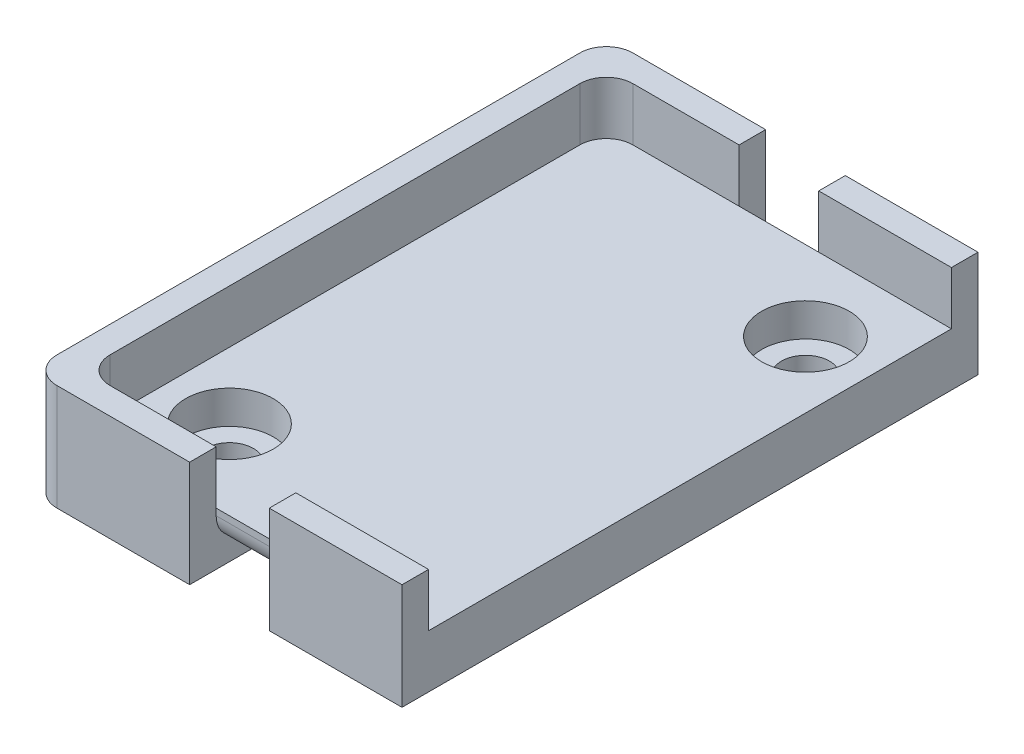
ISO-10303-21;
HEADER;
FILE_DESCRIPTION(('STEP AP214'),'2;1');
FILE_NAME('part.step','',(''),(''),'','','');
FILE_SCHEMA(('AUTOMOTIVE_DESIGN { 1 0 10303 214 1 1 1 1 }'));
ENDSEC;
DATA;
#1=APPLICATION_CONTEXT('core data for automotive mechanical design processes');
#2=APPLICATION_PROTOCOL_DEFINITION('international standard','automotive_design',2000,#1);
#3=PRODUCT_CONTEXT('',#1,'mechanical');
#4=PRODUCT('Part','Part','',(#3));
#5=PRODUCT_RELATED_PRODUCT_CATEGORY('part','',(#4));
#6=PRODUCT_DEFINITION_FORMATION('','',#4);
#7=PRODUCT_DEFINITION_CONTEXT('part definition',#1,'design');
#8=PRODUCT_DEFINITION('design','',#6,#7);
#9=PRODUCT_DEFINITION_SHAPE('','',#8);
#10=(LENGTH_UNIT() NAMED_UNIT(*) SI_UNIT(.MILLI.,.METRE.));
#11=(NAMED_UNIT(*) PLANE_ANGLE_UNIT() SI_UNIT($,.RADIAN.));
#12=(NAMED_UNIT(*) SI_UNIT($,.STERADIAN.) SOLID_ANGLE_UNIT());
#13=UNCERTAINTY_MEASURE_WITH_UNIT(LENGTH_MEASURE(1.E-05),#10,'distance_accuracy_value','');
#14=(GEOMETRIC_REPRESENTATION_CONTEXT(3) GLOBAL_UNCERTAINTY_ASSIGNED_CONTEXT((#13)) GLOBAL_UNIT_ASSIGNED_CONTEXT((#10,
#11,#12)) REPRESENTATION_CONTEXT('',''));
#15=CARTESIAN_POINT('',(0.,0.,0.));
#16=DIRECTION('',(0.,0.,1.));
#17=DIRECTION('',(1.,0.,0.));
#18=AXIS2_PLACEMENT_3D('',#15,#16,#17);
#19=CARTESIAN_POINT('',(0.,5.08,0.));
#20=DIRECTION('',(0.,1.,0.));
#21=DIRECTION('',(0.,0.,1.));
#22=AXIS2_PLACEMENT_3D('',#19,#20,#21);
#23=PLANE('',#22);
#24=CARTESIAN_POINT('',(26.67,5.08,-42.418));
#25=DIRECTION('',(0.,1.,0.));
#26=DIRECTION('',(0.,0.,1.));
#27=AXIS2_PLACEMENT_3D('',#24,#25,#26);
#28=CIRCLE('',#27,4.191);
#29=CARTESIAN_POINT('',(26.67,5.08,-38.227));
#30=VERTEX_POINT('',#29);
#31=EDGE_CURVE('E314',#30,#30,#28,.T.);
#32=ORIENTED_EDGE('',*,*,#31,.F.);
#33=EDGE_LOOP('',(#32));
#34=FACE_BOUND('',#33,.T.);
#35=CARTESIAN_POINT('',(6.35,5.08,-7.62));
#36=DIRECTION('',(0.,1.,0.));
#37=DIRECTION('',(0.,0.,1.));
#38=AXIS2_PLACEMENT_3D('',#35,#36,#37);
#39=CIRCLE('',#38,4.191);
#40=CARTESIAN_POINT('',(6.35,5.08,-3.429));
#41=VERTEX_POINT('',#40);
#42=EDGE_CURVE('E311',#41,#41,#39,.T.);
#43=ORIENTED_EDGE('',*,*,#42,.F.);
#44=EDGE_LOOP('',(#43));
#45=FACE_BOUND('',#44,.T.);
#46=DIRECTION('',(1.,0.,0.));
#47=VECTOR('',#46,1.);
#48=CARTESIAN_POINT('',(0.,5.08,-50.038));
#49=LINE('',#48,#47);
#50=CARTESIAN_POINT('',(2.54,5.08,-50.038));
#51=VERTEX_POINT('',#50);
#52=CARTESIAN_POINT('',(12.7,5.08,-50.038));
#53=VERTEX_POINT('',#52);
#54=EDGE_CURVE('E259',#51,#53,#49,.T.);
#55=ORIENTED_EDGE('',*,*,#54,.F.);
#56=CARTESIAN_POINT('',(2.54,5.08,-47.498));
#57=DIRECTION('',(0.,1.,0.));
#58=DIRECTION('',(0.,0.,1.));
#59=AXIS2_PLACEMENT_3D('',#56,#57,#58);
#60=CIRCLE('',#59,2.54);
#61=CARTESIAN_POINT('',(0.,5.08,-47.498));
#62=VERTEX_POINT('',#61);
#63=EDGE_CURVE('E389',#51,#62,#60,.T.);
#64=ORIENTED_EDGE('',*,*,#63,.T.);
#65=DIRECTION('',(0.,0.,-1.));
#66=VECTOR('',#65,1.);
#67=CARTESIAN_POINT('',(0.,5.08,0.));
#68=LINE('',#67,#66);
#69=CARTESIAN_POINT('',(0.,5.08,-2.54));
#70=VERTEX_POINT('',#69);
#71=EDGE_CURVE('E278',#70,#62,#68,.T.);
#72=ORIENTED_EDGE('',*,*,#71,.F.);
#73=CARTESIAN_POINT('',(2.54,5.08,-2.54));
#74=DIRECTION('',(0.,1.,0.));
#75=DIRECTION('',(0.,0.,1.));
#76=AXIS2_PLACEMENT_3D('',#73,#74,#75);
#77=CIRCLE('',#76,2.54);
#78=CARTESIAN_POINT('',(2.54,5.08,0.));
#79=VERTEX_POINT('',#78);
#80=EDGE_CURVE('E387',#70,#79,#77,.T.);
#81=ORIENTED_EDGE('',*,*,#80,.T.);
#82=DIRECTION('',(1.,0.,0.));
#83=VECTOR('',#82,1.);
#84=CARTESIAN_POINT('',(0.,5.08,0.));
#85=LINE('',#84,#83);
#86=CARTESIAN_POINT('',(12.7,5.08,0.));
#87=VERTEX_POINT('',#86);
#88=EDGE_CURVE('E254',#79,#87,#85,.T.);
#89=ORIENTED_EDGE('',*,*,#88,.T.);
#90=DIRECTION('',(1.,0.,0.));
#91=VECTOR('',#90,1.);
#92=CARTESIAN_POINT('',(0.,5.08,0.));
#93=LINE('',#92,#91);
#94=CARTESIAN_POINT('',(20.32,5.08,0.));
#95=VERTEX_POINT('',#94);
#96=EDGE_CURVE('E306',#87,#95,#93,.T.);
#97=ORIENTED_EDGE('',*,*,#96,.T.);
#98=DIRECTION('',(1.,0.,0.));
#99=VECTOR('',#98,1.);
#100=CARTESIAN_POINT('',(0.,5.08,0.));
#101=LINE('',#100,#99);
#102=CARTESIAN_POINT('',(33.02,5.08,0.));
#103=VERTEX_POINT('',#102);
#104=EDGE_CURVE('E234',#95,#103,#101,.T.);
#105=ORIENTED_EDGE('',*,*,#104,.T.);
#106=DIRECTION('',(0.,0.,-1.));
#107=VECTOR('',#106,1.);
#108=CARTESIAN_POINT('',(33.02,5.08,0.));
#109=LINE('',#108,#107);
#110=CARTESIAN_POINT('',(33.02,5.08,-50.038));
#111=VERTEX_POINT('',#110);
#112=EDGE_CURVE('E309',#103,#111,#109,.T.);
#113=ORIENTED_EDGE('',*,*,#112,.T.);
#114=DIRECTION('',(1.,0.,0.));
#115=VECTOR('',#114,1.);
#116=CARTESIAN_POINT('',(0.,5.08,-50.038));
#117=LINE('',#116,#115);
#118=CARTESIAN_POINT('',(20.32,5.08,-50.038));
#119=VERTEX_POINT('',#118);
#120=EDGE_CURVE('E223',#119,#111,#117,.T.);
#121=ORIENTED_EDGE('',*,*,#120,.F.);
#122=DIRECTION('',(1.,0.,0.));
#123=VECTOR('',#122,1.);
#124=CARTESIAN_POINT('',(0.,5.08,-50.038));
#125=LINE('',#124,#123);
#126=EDGE_CURVE('E303',#53,#119,#125,.T.);
#127=ORIENTED_EDGE('',*,*,#126,.F.);
#128=EDGE_LOOP('',(#55,#64,#72,#81,#89,#97,#105,#113,#121,#127));
#129=FACE_BOUND('',#128,.T.);
#130=ADVANCED_FACE('F34',(#34,#45,#129),#23,.T.);
#131=CARTESIAN_POINT('',(0.,1.905,0.));
#132=DIRECTION('',(0.,1.,0.));
#133=DIRECTION('',(0.,0.,1.));
#134=AXIS2_PLACEMENT_3D('',#131,#132,#133);
#135=PLANE('',#134);
#136=DIRECTION('',(0.,0.,1.));
#137=VECTOR('',#136,1.);
#138=CARTESIAN_POINT('',(12.7,1.905,0.));
#139=LINE('',#138,#137);
#140=CARTESIAN_POINT('',(12.7,1.905,-47.498));
#141=VERTEX_POINT('',#140);
#142=CARTESIAN_POINT('',(12.7,1.905,-2.54));
#143=VERTEX_POINT('',#142);
#144=EDGE_CURVE('E336',#141,#143,#139,.T.);
#145=ORIENTED_EDGE('',*,*,#144,.F.);
#146=DIRECTION('',(1.,0.,0.));
#147=VECTOR('',#146,1.);
#148=CARTESIAN_POINT('',(20.32,1.905,-47.498));
#149=LINE('',#148,#147);
#150=CARTESIAN_POINT('',(20.32,1.905,-47.498));
#151=VERTEX_POINT('',#150);
#152=EDGE_CURVE('E344',#141,#151,#149,.T.);
#153=ORIENTED_EDGE('',*,*,#152,.T.);
#154=DIRECTION('',(0.,0.,-1.));
#155=VECTOR('',#154,1.);
#156=CARTESIAN_POINT('',(20.32,1.905,0.));
#157=LINE('',#156,#155);
#158=CARTESIAN_POINT('',(20.32,1.905,-2.54));
#159=VERTEX_POINT('',#158);
#160=EDGE_CURVE('E360',#159,#151,#157,.T.);
#161=ORIENTED_EDGE('',*,*,#160,.F.);
#162=DIRECTION('',(1.,0.,0.));
#163=VECTOR('',#162,1.);
#164=CARTESIAN_POINT('',(0.,1.905,-2.54));
#165=LINE('',#164,#163);
#166=EDGE_CURVE('E342',#159,#143,#165,.F.);
#167=ORIENTED_EDGE('',*,*,#166,.T.);
#168=EDGE_LOOP('',(#145,#153,#161,#167));
#169=FACE_BOUND('',#168,.T.);
#170=ADVANCED_FACE('F364',(#169),#135,.F.);
#171=CARTESIAN_POINT('',(0.,1.905,0.));
#172=DIRECTION('',(0.,1.,0.));
#173=DIRECTION('',(0.,0.,1.));
#174=AXIS2_PLACEMENT_3D('',#171,#172,#173);
#175=PLANE('',#174);
#176=CARTESIAN_POINT('',(6.35,1.905,-7.62));
#177=DIRECTION('',(0.,1.,0.));
#178=DIRECTION('',(0.,0.,1.));
#179=AXIS2_PLACEMENT_3D('',#176,#177,#178);
#180=CIRCLE('',#179,2.28599999999999);
#181=CARTESIAN_POINT('',(6.35,1.905,-5.334));
#182=VERTEX_POINT('',#181);
#183=EDGE_CURVE('E333',#182,#182,#180,.T.);
#184=ORIENTED_EDGE('',*,*,#183,.F.);
#185=EDGE_LOOP('',(#184));
#186=FACE_BOUND('',#185,.T.);
#187=CARTESIAN_POINT('',(6.35,1.905,-7.62));
#188=DIRECTION('',(0.,1.,0.));
#189=DIRECTION('',(0.,0.,1.));
#190=AXIS2_PLACEMENT_3D('',#187,#188,#189);
#191=CIRCLE('',#190,4.191);
#192=CARTESIAN_POINT('',(6.35,1.905,-3.429));
#193=VERTEX_POINT('',#192);
#194=EDGE_CURVE('E291',#193,#193,#191,.T.);
#195=ORIENTED_EDGE('',*,*,#194,.T.);
#196=EDGE_LOOP('',(#195));
#197=FACE_BOUND('',#196,.T.);
#198=ADVANCED_FACE('F447',(#186,#197),#175,.T.);
#199=CARTESIAN_POINT('',(12.7,1.905,0.));
#200=DIRECTION('',(1.,0.,0.));
#201=DIRECTION('',(0.,0.,-1.));
#202=AXIS2_PLACEMENT_3D('',#199,#200,#201);
#203=PLANE('',#202);
#204=DIRECTION('',(0.,0.,1.));
#205=VECTOR('',#204,1.);
#206=CARTESIAN_POINT('',(12.7,0.,0.));
#207=LINE('',#206,#205);
#208=CARTESIAN_POINT('',(12.7,0.,-52.578));
#209=VERTEX_POINT('',#208);
#210=CARTESIAN_POINT('',(12.7,0.,2.54));
#211=VERTEX_POINT('',#210);
#212=EDGE_CURVE('E376',#209,#211,#207,.T.);
#213=ORIENTED_EDGE('',*,*,#212,.F.);
#214=DIRECTION('',(0.,-1.,0.));
#215=VECTOR('',#214,1.);
#216=CARTESIAN_POINT('',(12.7,1.905,-52.578));
#217=LINE('',#216,#215);
#218=CARTESIAN_POINT('',(12.7,10.16,-52.578));
#219=VERTEX_POINT('',#218);
#220=EDGE_CURVE('E367',#219,#209,#217,.T.);
#221=ORIENTED_EDGE('',*,*,#220,.F.);
#222=DIRECTION('',(0.,0.,1.));
#223=VECTOR('',#222,1.);
#224=CARTESIAN_POINT('',(12.7,10.16,0.));
#225=LINE('',#224,#223);
#226=CARTESIAN_POINT('',(12.7,10.16,-50.038));
#227=VERTEX_POINT('',#226);
#228=EDGE_CURVE('E255',#219,#227,#225,.T.);
#229=ORIENTED_EDGE('',*,*,#228,.T.);
#230=DIRECTION('',(0.,-1.,0.));
#231=VECTOR('',#230,1.);
#232=CARTESIAN_POINT('',(12.7,10.16,-50.038));
#233=LINE('',#232,#231);
#234=EDGE_CURVE('E276',#227,#53,#233,.T.);
#235=ORIENTED_EDGE('',*,*,#234,.T.);
#236=DIRECTION('',(0.,-1.,0.));
#237=VECTOR('',#236,1.);
#238=CARTESIAN_POINT('',(12.7,5.08,-50.038));
#239=LINE('',#238,#237);
#240=CARTESIAN_POINT('',(12.7,4.445,-50.038));
#241=VERTEX_POINT('',#240);
#242=EDGE_CURVE('E373',#53,#241,#239,.T.);
#243=ORIENTED_EDGE('',*,*,#242,.T.);
#244=CARTESIAN_POINT('',(12.7,4.445,-47.498));
#245=DIRECTION('',(1.,0.,0.));
#246=DIRECTION('',(0.,0.,-1.));
#247=AXIS2_PLACEMENT_3D('',#244,#245,#246);
#248=CIRCLE('',#247,2.54);
#249=EDGE_CURVE('E357',#241,#141,#248,.F.);
#250=ORIENTED_EDGE('',*,*,#249,.T.);
#251=ORIENTED_EDGE('',*,*,#144,.T.);
#252=CARTESIAN_POINT('',(12.7,4.445,-2.54));
#253=DIRECTION('',(1.,0.,0.));
#254=DIRECTION('',(0.,0.,-1.));
#255=AXIS2_PLACEMENT_3D('',#252,#253,#254);
#256=CIRCLE('',#255,2.54);
#257=CARTESIAN_POINT('',(12.7,4.445,0.));
#258=VERTEX_POINT('',#257);
#259=EDGE_CURVE('E11',#143,#258,#256,.F.);
#260=ORIENTED_EDGE('',*,*,#259,.T.);
#261=DIRECTION('',(0.,-1.,0.));
#262=VECTOR('',#261,1.);
#263=CARTESIAN_POINT('',(12.7,5.08,0.));
#264=LINE('',#263,#262);
#265=EDGE_CURVE('E330',#87,#258,#264,.T.);
#266=ORIENTED_EDGE('',*,*,#265,.F.);
#267=DIRECTION('',(0.,-1.,0.));
#268=VECTOR('',#267,1.);
#269=CARTESIAN_POINT('',(12.7,10.16,0.));
#270=LINE('',#269,#268);
#271=CARTESIAN_POINT('',(12.7,10.16,0.));
#272=VERTEX_POINT('',#271);
#273=EDGE_CURVE('E284',#272,#87,#270,.T.);
#274=ORIENTED_EDGE('',*,*,#273,.F.);
#275=CARTESIAN_POINT('',(12.7,10.16,2.54));
#276=VERTEX_POINT('',#275);
#277=EDGE_CURVE('E260',#272,#276,#225,.T.);
#278=ORIENTED_EDGE('',*,*,#277,.T.);
#279=DIRECTION('',(0.,-1.,0.));
#280=VECTOR('',#279,1.);
#281=CARTESIAN_POINT('',(12.7,1.905,2.54));
#282=LINE('',#281,#280);
#283=EDGE_CURVE('E439',#276,#211,#282,.T.);
#284=ORIENTED_EDGE('',*,*,#283,.T.);
#285=EDGE_LOOP('',(#213,#221,#229,#235,#243,#250,#251,#260,#266,#274,#278,#284));
#286=FACE_BOUND('',#285,.T.);
#287=ADVANCED_FACE('F450',(#286),#203,.T.);
#288=CARTESIAN_POINT('',(0.,1.905,-52.578));
#289=DIRECTION('',(0.,0.,1.));
#290=DIRECTION('',(1.,0.,0.));
#291=AXIS2_PLACEMENT_3D('',#288,#289,#290);
#292=PLANE('',#291);
#293=DIRECTION('',(-1.,0.,0.));
#294=VECTOR('',#293,1.);
#295=CARTESIAN_POINT('',(0.,0.,-52.578));
#296=LINE('',#295,#294);
#297=CARTESIAN_POINT('',(0.,0.,-52.578));
#298=VERTEX_POINT('',#297);
#299=EDGE_CURVE('E436',#209,#298,#296,.T.);
#300=ORIENTED_EDGE('',*,*,#299,.T.);
#301=DIRECTION('',(0.,-1.,0.));
#302=VECTOR('',#301,1.);
#303=CARTESIAN_POINT('',(0.,10.16,-52.578));
#304=LINE('',#303,#302);
#305=CARTESIAN_POINT('',(0.,10.16,-52.578));
#306=VERTEX_POINT('',#305);
#307=EDGE_CURVE('E407',#298,#306,#304,.F.);
#308=ORIENTED_EDGE('',*,*,#307,.T.);
#309=DIRECTION('',(-1.,0.,0.));
#310=VECTOR('',#309,1.);
#311=CARTESIAN_POINT('',(0.,10.16,-52.578));
#312=LINE('',#311,#310);
#313=EDGE_CURVE('E258',#219,#306,#312,.T.);
#314=ORIENTED_EDGE('',*,*,#313,.F.);
#315=ORIENTED_EDGE('',*,*,#220,.T.);
#316=EDGE_LOOP('',(#300,#308,#314,#315));
#317=FACE_BOUND('',#316,.T.);
#318=ADVANCED_FACE('F580',(#317),#292,.F.);
#319=CARTESIAN_POINT('',(-2.54,1.905,0.));
#320=DIRECTION('',(-1.,0.,0.));
#321=DIRECTION('',(0.,0.,1.));
#322=AXIS2_PLACEMENT_3D('',#319,#320,#321);
#323=PLANE('',#322);
#324=DIRECTION('',(0.,0.,-1.));
#325=VECTOR('',#324,1.);
#326=CARTESIAN_POINT('',(-2.54,10.16,0.));
#327=LINE('',#326,#325);
#328=CARTESIAN_POINT('',(-2.54,10.16,0.));
#329=VERTEX_POINT('',#328);
#330=CARTESIAN_POINT('',(-2.54,10.16,-50.038));
#331=VERTEX_POINT('',#330);
#332=EDGE_CURVE('E263',#329,#331,#327,.T.);
#333=ORIENTED_EDGE('',*,*,#332,.T.);
#334=DIRECTION('',(0.,-1.,0.));
#335=VECTOR('',#334,1.);
#336=CARTESIAN_POINT('',(-2.54,0.,-50.038));
#337=LINE('',#336,#335);
#338=CARTESIAN_POINT('',(-2.54,0.,-50.038));
#339=VERTEX_POINT('',#338);
#340=EDGE_CURVE('E400',#331,#339,#337,.T.);
#341=ORIENTED_EDGE('',*,*,#340,.T.);
#342=DIRECTION('',(0.,0.,-1.));
#343=VECTOR('',#342,1.);
#344=CARTESIAN_POINT('',(-2.54,0.,0.));
#345=LINE('',#344,#343);
#346=CARTESIAN_POINT('',(-2.54,0.,0.));
#347=VERTEX_POINT('',#346);
#348=EDGE_CURVE('E432',#347,#339,#345,.T.);
#349=ORIENTED_EDGE('',*,*,#348,.F.);
#350=DIRECTION('',(0.,-1.,0.));
#351=VECTOR('',#350,1.);
#352=CARTESIAN_POINT('',(-2.54,1.905,0.));
#353=LINE('',#352,#351);
#354=EDGE_CURVE('E398',#347,#329,#353,.F.);
#355=ORIENTED_EDGE('',*,*,#354,.T.);
#356=EDGE_LOOP('',(#333,#341,#349,#355));
#357=FACE_BOUND('',#356,.T.);
#358=ADVANCED_FACE('F575',(#357),#323,.T.);
#359=CARTESIAN_POINT('',(0.,1.905,2.54));
#360=DIRECTION('',(0.,0.,1.));
#361=DIRECTION('',(1.,0.,0.));
#362=AXIS2_PLACEMENT_3D('',#359,#360,#361);
#363=PLANE('',#362);
#364=DIRECTION('',(-1.,0.,0.));
#365=VECTOR('',#364,1.);
#366=CARTESIAN_POINT('',(0.,10.16,2.54));
#367=LINE('',#366,#365);
#368=CARTESIAN_POINT('',(0.,10.16,2.54));
#369=VERTEX_POINT('',#368);
#370=EDGE_CURVE('E266',#276,#369,#367,.T.);
#371=ORIENTED_EDGE('',*,*,#370,.T.);
#372=DIRECTION('',(0.,-1.,0.));
#373=VECTOR('',#372,1.);
#374=CARTESIAN_POINT('',(0.,1.905,2.54));
#375=LINE('',#374,#373);
#376=CARTESIAN_POINT('',(0.,0.,2.54));
#377=VERTEX_POINT('',#376);
#378=EDGE_CURVE('E340',#369,#377,#375,.T.);
#379=ORIENTED_EDGE('',*,*,#378,.T.);
#380=DIRECTION('',(-1.,0.,0.));
#381=VECTOR('',#380,1.);
#382=CARTESIAN_POINT('',(0.,0.,2.54));
#383=LINE('',#382,#381);
#384=EDGE_CURVE('E420',#211,#377,#383,.T.);
#385=ORIENTED_EDGE('',*,*,#384,.F.);
#386=ORIENTED_EDGE('',*,*,#283,.F.);
#387=EDGE_LOOP('',(#371,#379,#385,#386));
#388=FACE_BOUND('',#387,.T.);
#389=ADVANCED_FACE('F419',(#388),#363,.T.);
#390=CARTESIAN_POINT('',(6.35,1.905,-7.62));
#391=DIRECTION('',(0.,-1.,0.));
#392=DIRECTION('',(0.,0.,-1.));
#393=AXIS2_PLACEMENT_3D('',#390,#391,#392);
#394=CYLINDRICAL_SURFACE('',#393,2.28599999999999);
#395=ORIENTED_EDGE('',*,*,#183,.T.);
#396=EDGE_LOOP('',(#395));
#397=FACE_BOUND('',#396,.T.);
#398=CARTESIAN_POINT('',(6.35,0.,-7.62));
#399=DIRECTION('',(0.,1.,0.));
#400=DIRECTION('',(0.,0.,1.));
#401=AXIS2_PLACEMENT_3D('',#398,#399,#400);
#402=CIRCLE('',#401,2.28599999999999);
#403=CARTESIAN_POINT('',(6.35,0.,-5.334));
#404=VERTEX_POINT('',#403);
#405=EDGE_CURVE('E339',#404,#404,#402,.T.);
#406=ORIENTED_EDGE('',*,*,#405,.F.);
#407=EDGE_LOOP('',(#406));
#408=FACE_BOUND('',#407,.T.);
#409=ADVANCED_FACE('F444',(#397,#408),#394,.F.);
#410=CARTESIAN_POINT('',(0.,0.,0.));
#411=DIRECTION('',(0.,1.,0.));
#412=DIRECTION('',(0.,0.,1.));
#413=AXIS2_PLACEMENT_3D('',#410,#411,#412);
#414=PLANE('',#413);
#415=ORIENTED_EDGE('',*,*,#348,.T.);
#416=CARTESIAN_POINT('',(0.,0.,-50.038));
#417=DIRECTION('',(0.,1.,0.));
#418=DIRECTION('',(0.,0.,1.));
#419=AXIS2_PLACEMENT_3D('',#416,#417,#418);
#420=CIRCLE('',#419,2.54);
#421=EDGE_CURVE('E405',#339,#298,#420,.F.);
#422=ORIENTED_EDGE('',*,*,#421,.T.);
#423=ORIENTED_EDGE('',*,*,#299,.F.);
#424=ORIENTED_EDGE('',*,*,#212,.T.);
#425=ORIENTED_EDGE('',*,*,#384,.T.);
#426=CARTESIAN_POINT('',(0.,0.,0.));
#427=DIRECTION('',(0.,1.,0.));
#428=DIRECTION('',(0.,0.,1.));
#429=AXIS2_PLACEMENT_3D('',#426,#427,#428);
#430=CIRCLE('',#429,2.54);
#431=EDGE_CURVE('E403',#377,#347,#430,.F.);
#432=ORIENTED_EDGE('',*,*,#431,.T.);
#433=EDGE_LOOP('',(#415,#422,#423,#424,#425,#432));
#434=FACE_BOUND('',#433,.T.);
#435=ORIENTED_EDGE('',*,*,#405,.T.);
#436=EDGE_LOOP('',(#435));
#437=FACE_BOUND('',#436,.T.);
#438=ADVANCED_FACE('F427',(#434,#437),#414,.F.);
#439=CARTESIAN_POINT('',(0.,5.08,-50.038));
#440=DIRECTION('',(0.,0.,-1.));
#441=DIRECTION('',(-1.,0.,0.));
#442=AXIS2_PLACEMENT_3D('',#439,#440,#441);
#443=PLANE('',#442);
#444=DIRECTION('',(0.,-1.,0.));
#445=VECTOR('',#444,1.);
#446=CARTESIAN_POINT('',(20.32,5.08,-50.038));
#447=LINE('',#446,#445);
#448=CARTESIAN_POINT('',(20.32,4.445,-50.038));
#449=VERTEX_POINT('',#448);
#450=EDGE_CURVE('E206',#119,#449,#447,.T.);
#451=ORIENTED_EDGE('',*,*,#450,.T.);
#452=DIRECTION('',(1.,0.,0.));
#453=VECTOR('',#452,1.);
#454=CARTESIAN_POINT('',(12.7,4.445,-50.038));
#455=LINE('',#454,#453);
#456=EDGE_CURVE('E347',#449,#241,#455,.F.);
#457=ORIENTED_EDGE('',*,*,#456,.T.);
#458=ORIENTED_EDGE('',*,*,#242,.F.);
#459=ORIENTED_EDGE('',*,*,#126,.T.);
#460=EDGE_LOOP('',(#451,#457,#458,#459));
#461=FACE_BOUND('',#460,.T.);
#462=ADVANCED_FACE('F551',(#461),#443,.T.);
#463=CARTESIAN_POINT('',(0.,5.08,0.));
#464=DIRECTION('',(0.,0.,-1.));
#465=DIRECTION('',(-1.,0.,0.));
#466=AXIS2_PLACEMENT_3D('',#463,#464,#465);
#467=PLANE('',#466);
#468=ORIENTED_EDGE('',*,*,#265,.T.);
#469=DIRECTION('',(1.,0.,0.));
#470=VECTOR('',#469,1.);
#471=CARTESIAN_POINT('',(0.,4.445,0.));
#472=LINE('',#471,#470);
#473=CARTESIAN_POINT('',(20.32,4.445,0.));
#474=VERTEX_POINT('',#473);
#475=EDGE_CURVE('E349',#258,#474,#472,.T.);
#476=ORIENTED_EDGE('',*,*,#475,.T.);
#477=DIRECTION('',(0.,-1.,0.));
#478=VECTOR('',#477,1.);
#479=CARTESIAN_POINT('',(20.32,5.08,0.));
#480=LINE('',#479,#478);
#481=EDGE_CURVE('E328',#95,#474,#480,.T.);
#482=ORIENTED_EDGE('',*,*,#481,.F.);
#483=ORIENTED_EDGE('',*,*,#96,.F.);
#484=EDGE_LOOP('',(#468,#476,#482,#483));
#485=FACE_BOUND('',#484,.T.);
#486=ADVANCED_FACE('F370',(#485),#467,.F.);
#487=CARTESIAN_POINT('',(20.32,5.08,0.));
#488=DIRECTION('',(1.,0.,0.));
#489=DIRECTION('',(0.,0.,-1.));
#490=AXIS2_PLACEMENT_3D('',#487,#488,#489);
#491=PLANE('',#490);
#492=ORIENTED_EDGE('',*,*,#481,.T.);
#493=CARTESIAN_POINT('',(20.32,4.445,-2.54));
#494=DIRECTION('',(1.,0.,0.));
#495=DIRECTION('',(0.,0.,-1.));
#496=AXIS2_PLACEMENT_3D('',#493,#494,#495);
#497=CIRCLE('',#496,2.54);
#498=EDGE_CURVE('E42',#474,#159,#497,.T.);
#499=ORIENTED_EDGE('',*,*,#498,.T.);
#500=ORIENTED_EDGE('',*,*,#160,.T.);
#501=CARTESIAN_POINT('',(20.32,4.445,-47.498));
#502=DIRECTION('',(1.,0.,0.));
#503=DIRECTION('',(0.,0.,-1.));
#504=AXIS2_PLACEMENT_3D('',#501,#502,#503);
#505=CIRCLE('',#504,2.54);
#506=EDGE_CURVE('E355',#151,#449,#505,.T.);
#507=ORIENTED_EDGE('',*,*,#506,.T.);
#508=ORIENTED_EDGE('',*,*,#450,.F.);
#509=DIRECTION('',(0.,-1.,0.));
#510=VECTOR('',#509,1.);
#511=CARTESIAN_POINT('',(20.32,10.16,-50.038));
#512=LINE('',#511,#510);
#513=CARTESIAN_POINT('',(20.32,10.16,-50.038));
#514=VERTEX_POINT('',#513);
#515=EDGE_CURVE('E214',#514,#119,#512,.T.);
#516=ORIENTED_EDGE('',*,*,#515,.F.);
#517=DIRECTION('',(0.,0.,1.));
#518=VECTOR('',#517,1.);
#519=CARTESIAN_POINT('',(20.32,10.16,0.));
#520=LINE('',#519,#518);
#521=CARTESIAN_POINT('',(20.32,10.16,-52.578));
#522=VERTEX_POINT('',#521);
#523=EDGE_CURVE('E209',#522,#514,#520,.T.);
#524=ORIENTED_EDGE('',*,*,#523,.F.);
#525=DIRECTION('',(0.,-1.,0.));
#526=VECTOR('',#525,1.);
#527=CARTESIAN_POINT('',(20.32,5.08,-52.578));
#528=LINE('',#527,#526);
#529=CARTESIAN_POINT('',(20.32,0.,-52.578));
#530=VERTEX_POINT('',#529);
#531=EDGE_CURVE('E195',#522,#530,#528,.T.);
#532=ORIENTED_EDGE('',*,*,#531,.T.);
#533=DIRECTION('',(0.,0.,1.));
#534=VECTOR('',#533,1.);
#535=CARTESIAN_POINT('',(20.32,0.,0.));
#536=LINE('',#535,#534);
#537=CARTESIAN_POINT('',(20.32,0.,2.54));
#538=VERTEX_POINT('',#537);
#539=EDGE_CURVE('E296',#530,#538,#536,.T.);
#540=ORIENTED_EDGE('',*,*,#539,.T.);
#541=DIRECTION('',(0.,-1.,0.));
#542=VECTOR('',#541,1.);
#543=CARTESIAN_POINT('',(20.32,5.08,2.54));
#544=LINE('',#543,#542);
#545=CARTESIAN_POINT('',(20.32,10.16,2.54));
#546=VERTEX_POINT('',#545);
#547=EDGE_CURVE('E326',#546,#538,#544,.T.);
#548=ORIENTED_EDGE('',*,*,#547,.F.);
#549=DIRECTION('',(0.,0.,1.));
#550=VECTOR('',#549,1.);
#551=CARTESIAN_POINT('',(20.32,10.16,0.));
#552=LINE('',#551,#550);
#553=CARTESIAN_POINT('',(20.32,10.16,0.));
#554=VERTEX_POINT('',#553);
#555=EDGE_CURVE('E238',#554,#546,#552,.T.);
#556=ORIENTED_EDGE('',*,*,#555,.F.);
#557=DIRECTION('',(0.,-1.,0.));
#558=VECTOR('',#557,1.);
#559=CARTESIAN_POINT('',(20.32,10.16,0.));
#560=LINE('',#559,#558);
#561=EDGE_CURVE('E251',#554,#95,#560,.T.);
#562=ORIENTED_EDGE('',*,*,#561,.T.);
#563=EDGE_LOOP('',(#492,#499,#500,#507,#508,#516,#524,#532,#540,#548,#556,#562));
#564=FACE_BOUND('',#563,.T.);
#565=ADVANCED_FACE('F211',(#564),#491,.F.);
#566=CARTESIAN_POINT('',(0.,5.08,2.54));
#567=DIRECTION('',(0.,0.,1.));
#568=DIRECTION('',(1.,0.,0.));
#569=AXIS2_PLACEMENT_3D('',#566,#567,#568);
#570=PLANE('',#569);
#571=ORIENTED_EDGE('',*,*,#547,.T.);
#572=DIRECTION('',(-1.,0.,0.));
#573=VECTOR('',#572,1.);
#574=CARTESIAN_POINT('',(0.,0.,2.54));
#575=LINE('',#574,#573);
#576=CARTESIAN_POINT('',(33.02,0.,2.54));
#577=VERTEX_POINT('',#576);
#578=EDGE_CURVE('E298',#577,#538,#575,.T.);
#579=ORIENTED_EDGE('',*,*,#578,.F.);
#580=DIRECTION('',(0.,-1.,0.));
#581=VECTOR('',#580,1.);
#582=CARTESIAN_POINT('',(33.02,5.08,2.54));
#583=LINE('',#582,#581);
#584=CARTESIAN_POINT('',(33.02,10.16,2.54));
#585=VERTEX_POINT('',#584);
#586=EDGE_CURVE('E324',#585,#577,#583,.T.);
#587=ORIENTED_EDGE('',*,*,#586,.F.);
#588=DIRECTION('',(-1.,0.,0.));
#589=VECTOR('',#588,1.);
#590=CARTESIAN_POINT('',(0.,10.16,2.54));
#591=LINE('',#590,#589);
#592=EDGE_CURVE('E241',#585,#546,#591,.T.);
#593=ORIENTED_EDGE('',*,*,#592,.T.);
#594=EDGE_LOOP('',(#571,#579,#587,#593));
#595=FACE_BOUND('',#594,.T.);
#596=ADVANCED_FACE('F564',(#595),#570,.T.);
#597=CARTESIAN_POINT('',(33.02,5.08,0.));
#598=DIRECTION('',(-1.,0.,0.));
#599=DIRECTION('',(0.,0.,1.));
#600=AXIS2_PLACEMENT_3D('',#597,#598,#599);
#601=PLANE('',#600);
#602=ORIENTED_EDGE('',*,*,#586,.T.);
#603=DIRECTION('',(0.,0.,-1.));
#604=VECTOR('',#603,1.);
#605=CARTESIAN_POINT('',(33.02,0.,0.));
#606=LINE('',#605,#604);
#607=CARTESIAN_POINT('',(33.02,0.,-52.578));
#608=VERTEX_POINT('',#607);
#609=EDGE_CURVE('E287',#577,#608,#606,.T.);
#610=ORIENTED_EDGE('',*,*,#609,.T.);
#611=DIRECTION('',(0.,-1.,0.));
#612=VECTOR('',#611,1.);
#613=CARTESIAN_POINT('',(33.02,5.08,-52.578));
#614=LINE('',#613,#612);
#615=CARTESIAN_POINT('',(33.02,10.16,-52.578));
#616=VERTEX_POINT('',#615);
#617=EDGE_CURVE('E205',#616,#608,#614,.T.);
#618=ORIENTED_EDGE('',*,*,#617,.F.);
#619=DIRECTION('',(0.,0.,-1.));
#620=VECTOR('',#619,1.);
#621=CARTESIAN_POINT('',(33.02,10.16,0.));
#622=LINE('',#621,#620);
#623=CARTESIAN_POINT('',(33.02,10.16,-50.038));
#624=VERTEX_POINT('',#623);
#625=EDGE_CURVE('E222',#624,#616,#622,.T.);
#626=ORIENTED_EDGE('',*,*,#625,.F.);
#627=DIRECTION('',(0.,-1.,0.));
#628=VECTOR('',#627,1.);
#629=CARTESIAN_POINT('',(33.02,10.16,-50.038));
#630=LINE('',#629,#628);
#631=EDGE_CURVE('E229',#624,#111,#630,.T.);
#632=ORIENTED_EDGE('',*,*,#631,.T.);
#633=ORIENTED_EDGE('',*,*,#112,.F.);
#634=DIRECTION('',(0.,-1.,0.));
#635=VECTOR('',#634,1.);
#636=CARTESIAN_POINT('',(33.02,10.16,0.));
#637=LINE('',#636,#635);
#638=CARTESIAN_POINT('',(33.02,10.16,0.));
#639=VERTEX_POINT('',#638);
#640=EDGE_CURVE('E246',#639,#103,#637,.T.);
#641=ORIENTED_EDGE('',*,*,#640,.F.);
#642=DIRECTION('',(0.,0.,-1.));
#643=VECTOR('',#642,1.);
#644=CARTESIAN_POINT('',(33.02,10.16,0.));
#645=LINE('',#644,#643);
#646=EDGE_CURVE('E244',#585,#639,#645,.T.);
#647=ORIENTED_EDGE('',*,*,#646,.F.);
#648=EDGE_LOOP('',(#602,#610,#618,#626,#632,#633,#641,#647));
#649=FACE_BOUND('',#648,.T.);
#650=ADVANCED_FACE('F466',(#649),#601,.F.);
#651=CARTESIAN_POINT('',(0.,5.08,-52.578));
#652=DIRECTION('',(0.,0.,1.));
#653=DIRECTION('',(1.,0.,0.));
#654=AXIS2_PLACEMENT_3D('',#651,#652,#653);
#655=PLANE('',#654);
#656=ORIENTED_EDGE('',*,*,#617,.T.);
#657=DIRECTION('',(-1.,0.,0.));
#658=VECTOR('',#657,1.);
#659=CARTESIAN_POINT('',(0.,0.,-52.578));
#660=LINE('',#659,#658);
#661=EDGE_CURVE('E201',#608,#530,#660,.T.);
#662=ORIENTED_EDGE('',*,*,#661,.T.);
#663=ORIENTED_EDGE('',*,*,#531,.F.);
#664=DIRECTION('',(-1.,0.,0.));
#665=VECTOR('',#664,1.);
#666=CARTESIAN_POINT('',(0.,10.16,-52.578));
#667=LINE('',#666,#665);
#668=EDGE_CURVE('E199',#616,#522,#667,.T.);
#669=ORIENTED_EDGE('',*,*,#668,.F.);
#670=EDGE_LOOP('',(#656,#662,#663,#669));
#671=FACE_BOUND('',#670,.T.);
#672=ADVANCED_FACE('F197',(#671),#655,.F.);
#673=CARTESIAN_POINT('',(6.35,5.08,-7.62));
#674=DIRECTION('',(0.,-1.,0.));
#675=DIRECTION('',(0.,0.,-1.));
#676=AXIS2_PLACEMENT_3D('',#673,#674,#675);
#677=CYLINDRICAL_SURFACE('',#676,4.191);
#678=ORIENTED_EDGE('',*,*,#42,.T.);
#679=EDGE_LOOP('',(#678));
#680=FACE_BOUND('',#679,.T.);
#681=ORIENTED_EDGE('',*,*,#194,.F.);
#682=EDGE_LOOP('',(#681));
#683=FACE_BOUND('',#682,.T.);
#684=ADVANCED_FACE('F454',(#680,#683),#677,.F.);
#685=CARTESIAN_POINT('',(26.67,5.08,-42.418));
#686=DIRECTION('',(0.,-1.,0.));
#687=DIRECTION('',(0.,0.,-1.));
#688=AXIS2_PLACEMENT_3D('',#685,#686,#687);
#689=CYLINDRICAL_SURFACE('',#688,4.191);
#690=ORIENTED_EDGE('',*,*,#31,.T.);
#691=EDGE_LOOP('',(#690));
#692=FACE_BOUND('',#691,.T.);
#693=CARTESIAN_POINT('',(26.67,1.905,-42.418));
#694=DIRECTION('',(0.,1.,0.));
#695=DIRECTION('',(0.,0.,1.));
#696=AXIS2_PLACEMENT_3D('',#693,#694,#695);
#697=CIRCLE('',#696,4.191);
#698=CARTESIAN_POINT('',(26.67,1.905,-38.227));
#699=VERTEX_POINT('',#698);
#700=EDGE_CURVE('E307',#699,#699,#697,.T.);
#701=ORIENTED_EDGE('',*,*,#700,.F.);
#702=EDGE_LOOP('',(#701));
#703=FACE_BOUND('',#702,.T.);
#704=ADVANCED_FACE('F456',(#692,#703),#689,.F.);
#705=CARTESIAN_POINT('',(26.67,1.905,-42.418));
#706=DIRECTION('',(0.,-1.,0.));
#707=DIRECTION('',(0.,0.,-1.));
#708=AXIS2_PLACEMENT_3D('',#705,#706,#707);
#709=CYLINDRICAL_SURFACE('',#708,2.286);
#710=CARTESIAN_POINT('',(26.67,1.905,-42.418));
#711=DIRECTION('',(0.,1.,0.));
#712=DIRECTION('',(0.,0.,1.));
#713=AXIS2_PLACEMENT_3D('',#710,#711,#712);
#714=CIRCLE('',#713,2.286);
#715=CARTESIAN_POINT('',(26.67,1.905,-40.132));
#716=VERTEX_POINT('',#715);
#717=EDGE_CURVE('E288',#716,#716,#714,.T.);
#718=ORIENTED_EDGE('',*,*,#717,.T.);
#719=EDGE_LOOP('',(#718));
#720=FACE_BOUND('',#719,.T.);
#721=CARTESIAN_POINT('',(26.67,0.,-42.418));
#722=DIRECTION('',(0.,1.,0.));
#723=DIRECTION('',(0.,0.,1.));
#724=AXIS2_PLACEMENT_3D('',#721,#722,#723);
#725=CIRCLE('',#724,2.286);
#726=CARTESIAN_POINT('',(26.67,0.,-40.132));
#727=VERTEX_POINT('',#726);
#728=EDGE_CURVE('E292',#727,#727,#725,.T.);
#729=ORIENTED_EDGE('',*,*,#728,.F.);
#730=EDGE_LOOP('',(#729));
#731=FACE_BOUND('',#730,.T.);
#732=ADVANCED_FACE('F463',(#720,#731),#709,.F.);
#733=CARTESIAN_POINT('',(0.,1.905,0.));
#734=DIRECTION('',(0.,1.,0.));
#735=DIRECTION('',(0.,0.,1.));
#736=AXIS2_PLACEMENT_3D('',#733,#734,#735);
#737=PLANE('',#736);
#738=ORIENTED_EDGE('',*,*,#700,.T.);
#739=EDGE_LOOP('',(#738));
#740=FACE_BOUND('',#739,.T.);
#741=ORIENTED_EDGE('',*,*,#717,.F.);
#742=EDGE_LOOP('',(#741));
#743=FACE_BOUND('',#742,.T.);
#744=ADVANCED_FACE('F480',(#740,#743),#737,.T.);
#745=CARTESIAN_POINT('',(0.,0.,0.));
#746=DIRECTION('',(0.,1.,0.));
#747=DIRECTION('',(0.,0.,1.));
#748=AXIS2_PLACEMENT_3D('',#745,#746,#747);
#749=PLANE('',#748);
#750=ORIENTED_EDGE('',*,*,#609,.F.);
#751=ORIENTED_EDGE('',*,*,#578,.T.);
#752=ORIENTED_EDGE('',*,*,#539,.F.);
#753=ORIENTED_EDGE('',*,*,#661,.F.);
#754=EDGE_LOOP('',(#750,#751,#752,#753));
#755=FACE_BOUND('',#754,.T.);
#756=ORIENTED_EDGE('',*,*,#728,.T.);
#757=EDGE_LOOP('',(#756));
#758=FACE_BOUND('',#757,.T.);
#759=ADVANCED_FACE('F482',(#755,#758),#749,.F.);
#760=CARTESIAN_POINT('',(0.,10.16,0.));
#761=DIRECTION('',(0.,0.,-1.));
#762=DIRECTION('',(-1.,0.,0.));
#763=AXIS2_PLACEMENT_3D('',#760,#761,#762);
#764=PLANE('',#763);
#765=ORIENTED_EDGE('',*,*,#88,.F.);
#766=DIRECTION('',(0.,-1.,0.));
#767=VECTOR('',#766,1.);
#768=CARTESIAN_POINT('',(2.54,10.16,0.));
#769=LINE('',#768,#767);
#770=CARTESIAN_POINT('',(2.54,10.16,0.));
#771=VERTEX_POINT('',#770);
#772=EDGE_CURVE('E396',#79,#771,#769,.F.);
#773=ORIENTED_EDGE('',*,*,#772,.T.);
#774=DIRECTION('',(1.,0.,0.));
#775=VECTOR('',#774,1.);
#776=CARTESIAN_POINT('',(0.,10.16,0.));
#777=LINE('',#776,#775);
#778=EDGE_CURVE('E269',#771,#272,#777,.T.);
#779=ORIENTED_EDGE('',*,*,#778,.T.);
#780=ORIENTED_EDGE('',*,*,#273,.T.);
#781=EDGE_LOOP('',(#765,#773,#779,#780));
#782=FACE_BOUND('',#781,.T.);
#783=ADVANCED_FACE('F485',(#782),#764,.T.);
#784=CARTESIAN_POINT('',(0.,10.16,0.));
#785=DIRECTION('',(-1.,0.,0.));
#786=DIRECTION('',(0.,0.,1.));
#787=AXIS2_PLACEMENT_3D('',#784,#785,#786);
#788=PLANE('',#787);
#789=ORIENTED_EDGE('',*,*,#71,.T.);
#790=DIRECTION('',(0.,-1.,0.));
#791=VECTOR('',#790,1.);
#792=CARTESIAN_POINT('',(0.,10.16,-47.498));
#793=LINE('',#792,#791);
#794=CARTESIAN_POINT('',(0.,10.16,-47.498));
#795=VERTEX_POINT('',#794);
#796=EDGE_CURVE('E394',#62,#795,#793,.F.);
#797=ORIENTED_EDGE('',*,*,#796,.T.);
#798=DIRECTION('',(0.,0.,-1.));
#799=VECTOR('',#798,1.);
#800=CARTESIAN_POINT('',(0.,10.16,0.));
#801=LINE('',#800,#799);
#802=CARTESIAN_POINT('',(0.,10.16,-2.54));
#803=VERTEX_POINT('',#802);
#804=EDGE_CURVE('E271',#803,#795,#801,.T.);
#805=ORIENTED_EDGE('',*,*,#804,.F.);
#806=DIRECTION('',(0.,-1.,0.));
#807=VECTOR('',#806,1.);
#808=CARTESIAN_POINT('',(0.,10.16,-2.54));
#809=LINE('',#808,#807);
#810=EDGE_CURVE('E391',#803,#70,#809,.T.);
#811=ORIENTED_EDGE('',*,*,#810,.T.);
#812=EDGE_LOOP('',(#789,#797,#805,#811));
#813=FACE_BOUND('',#812,.T.);
#814=ADVANCED_FACE('F492',(#813),#788,.F.);
#815=CARTESIAN_POINT('',(0.,10.16,-50.038));
#816=DIRECTION('',(0.,0.,-1.));
#817=DIRECTION('',(-1.,0.,0.));
#818=AXIS2_PLACEMENT_3D('',#815,#816,#817);
#819=PLANE('',#818);
#820=DIRECTION('',(1.,0.,0.));
#821=VECTOR('',#820,1.);
#822=CARTESIAN_POINT('',(0.,10.16,-50.038));
#823=LINE('',#822,#821);
#824=CARTESIAN_POINT('',(2.54,10.16,-50.038));
#825=VERTEX_POINT('',#824);
#826=EDGE_CURVE('E274',#825,#227,#823,.T.);
#827=ORIENTED_EDGE('',*,*,#826,.F.);
#828=DIRECTION('',(0.,-1.,0.));
#829=VECTOR('',#828,1.);
#830=CARTESIAN_POINT('',(2.54,5.08,-50.038));
#831=LINE('',#830,#829);
#832=EDGE_CURVE('E366',#825,#51,#831,.T.);
#833=ORIENTED_EDGE('',*,*,#832,.T.);
#834=ORIENTED_EDGE('',*,*,#54,.T.);
#835=ORIENTED_EDGE('',*,*,#234,.F.);
#836=EDGE_LOOP('',(#827,#833,#834,#835));
#837=FACE_BOUND('',#836,.T.);
#838=ADVANCED_FACE('F496',(#837),#819,.F.);
#839=CARTESIAN_POINT('',(0.,10.16,0.));
#840=DIRECTION('',(0.,1.,0.));
#841=DIRECTION('',(0.,0.,1.));
#842=AXIS2_PLACEMENT_3D('',#839,#840,#841);
#843=PLANE('',#842);
#844=ORIENTED_EDGE('',*,*,#313,.T.);
#845=CARTESIAN_POINT('',(0.,10.16,-50.038));
#846=DIRECTION('',(0.,1.,0.));
#847=DIRECTION('',(0.,0.,1.));
#848=AXIS2_PLACEMENT_3D('',#845,#846,#847);
#849=CIRCLE('',#848,2.54);
#850=EDGE_CURVE('E410',#306,#331,#849,.T.);
#851=ORIENTED_EDGE('',*,*,#850,.T.);
#852=ORIENTED_EDGE('',*,*,#332,.F.);
#853=CARTESIAN_POINT('',(0.,10.16,0.));
#854=DIRECTION('',(0.,1.,0.));
#855=DIRECTION('',(0.,0.,1.));
#856=AXIS2_PLACEMENT_3D('',#853,#854,#855);
#857=CIRCLE('',#856,2.54);
#858=EDGE_CURVE('E409',#329,#369,#857,.T.);
#859=ORIENTED_EDGE('',*,*,#858,.T.);
#860=ORIENTED_EDGE('',*,*,#370,.F.);
#861=ORIENTED_EDGE('',*,*,#277,.F.);
#862=ORIENTED_EDGE('',*,*,#778,.F.);
#863=CARTESIAN_POINT('',(2.54,10.16,-2.54));
#864=DIRECTION('',(0.,1.,0.));
#865=DIRECTION('',(0.,0.,1.));
#866=AXIS2_PLACEMENT_3D('',#863,#864,#865);
#867=CIRCLE('',#866,2.54);
#868=EDGE_CURVE('E353',#771,#803,#867,.F.);
#869=ORIENTED_EDGE('',*,*,#868,.T.);
#870=ORIENTED_EDGE('',*,*,#804,.T.);
#871=CARTESIAN_POINT('',(2.54,10.16,-47.498));
#872=DIRECTION('',(0.,1.,0.));
#873=DIRECTION('',(0.,0.,1.));
#874=AXIS2_PLACEMENT_3D('',#871,#872,#873);
#875=CIRCLE('',#874,2.54);
#876=EDGE_CURVE('E351',#795,#825,#875,.F.);
#877=ORIENTED_EDGE('',*,*,#876,.T.);
#878=ORIENTED_EDGE('',*,*,#826,.T.);
#879=ORIENTED_EDGE('',*,*,#228,.F.);
#880=EDGE_LOOP('',(#844,#851,#852,#859,#860,#861,#862,#869,#870,#877,#878,#879));
#881=FACE_BOUND('',#880,.T.);
#882=ADVANCED_FACE('F500',(#881),#843,.T.);
#883=CARTESIAN_POINT('',(0.,10.16,0.));
#884=DIRECTION('',(0.,0.,-1.));
#885=DIRECTION('',(-1.,0.,0.));
#886=AXIS2_PLACEMENT_3D('',#883,#884,#885);
#887=PLANE('',#886);
#888=ORIENTED_EDGE('',*,*,#104,.F.);
#889=ORIENTED_EDGE('',*,*,#561,.F.);
#890=DIRECTION('',(1.,0.,0.));
#891=VECTOR('',#890,1.);
#892=CARTESIAN_POINT('',(0.,10.16,0.));
#893=LINE('',#892,#891);
#894=EDGE_CURVE('E235',#554,#639,#893,.T.);
#895=ORIENTED_EDGE('',*,*,#894,.T.);
#896=ORIENTED_EDGE('',*,*,#640,.T.);
#897=EDGE_LOOP('',(#888,#889,#895,#896));
#898=FACE_BOUND('',#897,.T.);
#899=ADVANCED_FACE('F504',(#898),#887,.T.);
#900=CARTESIAN_POINT('',(0.,10.16,0.));
#901=DIRECTION('',(0.,1.,0.));
#902=DIRECTION('',(0.,0.,1.));
#903=AXIS2_PLACEMENT_3D('',#900,#901,#902);
#904=PLANE('',#903);
#905=ORIENTED_EDGE('',*,*,#894,.F.);
#906=ORIENTED_EDGE('',*,*,#555,.T.);
#907=ORIENTED_EDGE('',*,*,#592,.F.);
#908=ORIENTED_EDGE('',*,*,#646,.T.);
#909=EDGE_LOOP('',(#905,#906,#907,#908));
#910=FACE_BOUND('',#909,.T.);
#911=ADVANCED_FACE('F507',(#910),#904,.T.);
#912=CARTESIAN_POINT('',(0.,10.16,-50.038));
#913=DIRECTION('',(0.,0.,-1.));
#914=DIRECTION('',(-1.,0.,0.));
#915=AXIS2_PLACEMENT_3D('',#912,#913,#914);
#916=PLANE('',#915);
#917=ORIENTED_EDGE('',*,*,#120,.T.);
#918=ORIENTED_EDGE('',*,*,#631,.F.);
#919=DIRECTION('',(1.,0.,0.));
#920=VECTOR('',#919,1.);
#921=CARTESIAN_POINT('',(0.,10.16,-50.038));
#922=LINE('',#921,#920);
#923=EDGE_CURVE('E217',#514,#624,#922,.T.);
#924=ORIENTED_EDGE('',*,*,#923,.F.);
#925=ORIENTED_EDGE('',*,*,#515,.T.);
#926=EDGE_LOOP('',(#917,#918,#924,#925));
#927=FACE_BOUND('',#926,.T.);
#928=ADVANCED_FACE('F511',(#927),#916,.F.);
#929=CARTESIAN_POINT('',(0.,10.16,0.));
#930=DIRECTION('',(0.,1.,0.));
#931=DIRECTION('',(0.,0.,1.));
#932=AXIS2_PLACEMENT_3D('',#929,#930,#931);
#933=PLANE('',#932);
#934=ORIENTED_EDGE('',*,*,#668,.T.);
#935=ORIENTED_EDGE('',*,*,#523,.T.);
#936=ORIENTED_EDGE('',*,*,#923,.T.);
#937=ORIENTED_EDGE('',*,*,#625,.T.);
#938=EDGE_LOOP('',(#934,#935,#936,#937));
#939=FACE_BOUND('',#938,.T.);
#940=ADVANCED_FACE('F220',(#939),#933,.T.);
#941=CARTESIAN_POINT('',(2.54,10.16,-47.498));
#942=DIRECTION('',(0.,1.,0.));
#943=DIRECTION('',(0.,0.,1.));
#944=AXIS2_PLACEMENT_3D('',#941,#942,#943);
#945=CYLINDRICAL_SURFACE('',#944,2.54);
#946=ORIENTED_EDGE('',*,*,#876,.F.);
#947=ORIENTED_EDGE('',*,*,#796,.F.);
#948=ORIENTED_EDGE('',*,*,#63,.F.);
#949=ORIENTED_EDGE('',*,*,#832,.F.);
#950=EDGE_LOOP('',(#946,#947,#948,#949));
#951=FACE_BOUND('',#950,.T.);
#952=ADVANCED_FACE('F517',(#951),#945,.F.);
#953=CARTESIAN_POINT('',(2.54,10.16,-2.54));
#954=DIRECTION('',(0.,-1.,0.));
#955=DIRECTION('',(0.,0.,-1.));
#956=AXIS2_PLACEMENT_3D('',#953,#954,#955);
#957=CYLINDRICAL_SURFACE('',#956,2.54);
#958=ORIENTED_EDGE('',*,*,#868,.F.);
#959=ORIENTED_EDGE('',*,*,#772,.F.);
#960=ORIENTED_EDGE('',*,*,#80,.F.);
#961=ORIENTED_EDGE('',*,*,#810,.F.);
#962=EDGE_LOOP('',(#958,#959,#960,#961));
#963=FACE_BOUND('',#962,.T.);
#964=ADVANCED_FACE('F521',(#963),#957,.F.);
#965=CARTESIAN_POINT('',(0.,1.905,-50.038));
#966=DIRECTION('',(0.,1.,0.));
#967=DIRECTION('',(0.,0.,1.));
#968=AXIS2_PLACEMENT_3D('',#965,#966,#967);
#969=CYLINDRICAL_SURFACE('',#968,2.54);
#970=ORIENTED_EDGE('',*,*,#850,.F.);
#971=ORIENTED_EDGE('',*,*,#307,.F.);
#972=ORIENTED_EDGE('',*,*,#421,.F.);
#973=ORIENTED_EDGE('',*,*,#340,.F.);
#974=EDGE_LOOP('',(#970,#971,#972,#973));
#975=FACE_BOUND('',#974,.T.);
#976=ADVANCED_FACE('F527',(#975),#969,.T.);
#977=CARTESIAN_POINT('',(0.,1.905,0.));
#978=DIRECTION('',(0.,-1.,0.));
#979=DIRECTION('',(0.,0.,-1.));
#980=AXIS2_PLACEMENT_3D('',#977,#978,#979);
#981=CYLINDRICAL_SURFACE('',#980,2.54);
#982=ORIENTED_EDGE('',*,*,#858,.F.);
#983=ORIENTED_EDGE('',*,*,#354,.F.);
#984=ORIENTED_EDGE('',*,*,#431,.F.);
#985=ORIENTED_EDGE('',*,*,#378,.F.);
#986=EDGE_LOOP('',(#982,#983,#984,#985));
#987=FACE_BOUND('',#986,.T.);
#988=ADVANCED_FACE('F536',(#987),#981,.T.);
#989=CARTESIAN_POINT('',(0.,4.445,-47.498));
#990=DIRECTION('',(-1.,0.,0.));
#991=DIRECTION('',(0.,0.,1.));
#992=AXIS2_PLACEMENT_3D('',#989,#990,#991);
#993=CYLINDRICAL_SURFACE('',#992,2.54);
#994=ORIENTED_EDGE('',*,*,#249,.F.);
#995=ORIENTED_EDGE('',*,*,#456,.F.);
#996=ORIENTED_EDGE('',*,*,#506,.F.);
#997=ORIENTED_EDGE('',*,*,#152,.F.);
#998=EDGE_LOOP('',(#994,#995,#996,#997));
#999=FACE_BOUND('',#998,.T.);
#1000=ADVANCED_FACE('F539',(#999),#993,.T.);
#1001=CARTESIAN_POINT('',(0.,4.445,-2.54));
#1002=DIRECTION('',(1.,0.,0.));
#1003=DIRECTION('',(0.,0.,-1.));
#1004=AXIS2_PLACEMENT_3D('',#1001,#1002,#1003);
#1005=CYLINDRICAL_SURFACE('',#1004,2.54);
#1006=ORIENTED_EDGE('',*,*,#259,.F.);
#1007=ORIENTED_EDGE('',*,*,#166,.F.);
#1008=ORIENTED_EDGE('',*,*,#498,.F.);
#1009=ORIENTED_EDGE('',*,*,#475,.F.);
#1010=EDGE_LOOP('',(#1006,#1007,#1008,#1009));
#1011=FACE_BOUND('',#1010,.T.);
#1012=ADVANCED_FACE('F36',(#1011),#1005,.T.);
#1013=CLOSED_SHELL('',(#130,#170,#198,#287,#318,#358,#389,#409,#438,#462,#486,#565,#596,#650,
#672,#684,#704,#732,#744,#759,#783,#814,#838,#882,#899,#911,#928,#940,#952,#964,#976,#988,#1000,#1012));
#1014=MANIFOLD_SOLID_BREP('B2',#1013);
#1015=ADVANCED_BREP_SHAPE_REPRESENTATION('',(#18,#1014),#14);
#1016=SHAPE_DEFINITION_REPRESENTATION(#9,#1015);
ENDSEC;
END-ISO-10303-21;
